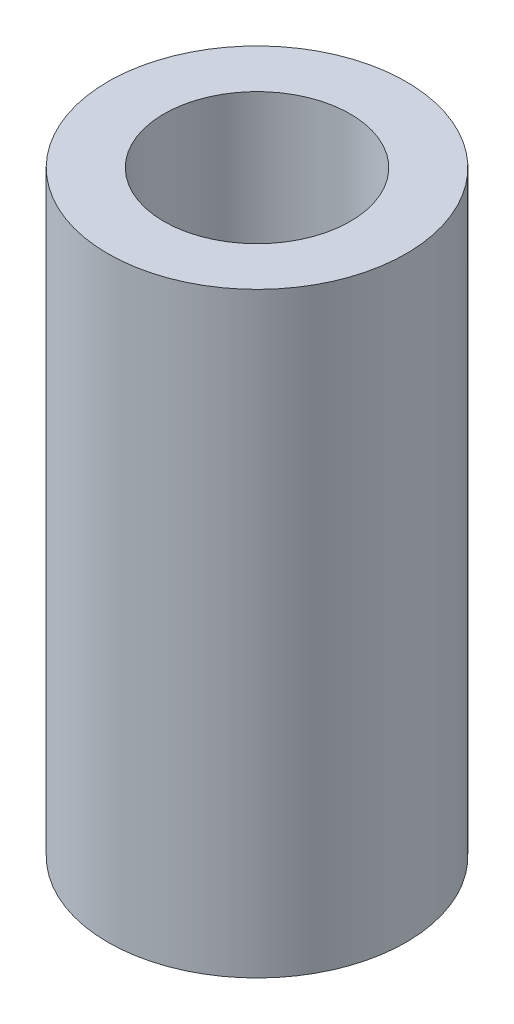
ISO-10303-21;
HEADER;
FILE_DESCRIPTION(('STEP AP214'),'2;1');
FILE_NAME('part.step','',(''),(''),'','','');
FILE_SCHEMA(('AUTOMOTIVE_DESIGN { 1 0 10303 214 1 1 1 1 }'));
ENDSEC;
DATA;
#1=APPLICATION_CONTEXT('core data for automotive mechanical design processes');
#2=APPLICATION_PROTOCOL_DEFINITION('international standard','automotive_design',2000,#1);
#3=PRODUCT_CONTEXT('',#1,'mechanical');
#4=PRODUCT('Part','Part','',(#3));
#5=PRODUCT_RELATED_PRODUCT_CATEGORY('part','',(#4));
#6=PRODUCT_DEFINITION_FORMATION('','',#4);
#7=PRODUCT_DEFINITION_CONTEXT('part definition',#1,'design');
#8=PRODUCT_DEFINITION('design','',#6,#7);
#9=PRODUCT_DEFINITION_SHAPE('','',#8);
#10=(LENGTH_UNIT() NAMED_UNIT(*) SI_UNIT(.MILLI.,.METRE.));
#11=(NAMED_UNIT(*) PLANE_ANGLE_UNIT() SI_UNIT($,.RADIAN.));
#12=(NAMED_UNIT(*) SI_UNIT($,.STERADIAN.) SOLID_ANGLE_UNIT());
#13=UNCERTAINTY_MEASURE_WITH_UNIT(LENGTH_MEASURE(1.E-05),#10,'distance_accuracy_value','');
#14=(GEOMETRIC_REPRESENTATION_CONTEXT(3) GLOBAL_UNCERTAINTY_ASSIGNED_CONTEXT((#13)) GLOBAL_UNIT_ASSIGNED_CONTEXT((#10,
#11,#12)) REPRESENTATION_CONTEXT('',''));
#15=CARTESIAN_POINT('',(0.,0.,0.));
#16=DIRECTION('',(0.,0.,1.));
#17=DIRECTION('',(1.,0.,0.));
#18=AXIS2_PLACEMENT_3D('',#15,#16,#17);
#19=CARTESIAN_POINT('',(0.,32.,0.));
#20=DIRECTION('',(0.,1.,0.));
#21=DIRECTION('',(0.,0.,1.));
#22=AXIS2_PLACEMENT_3D('',#19,#20,#21);
#23=PLANE('',#22);
#24=CARTESIAN_POINT('',(0.,32.,0.));
#25=DIRECTION('',(0.,1.,0.));
#26=DIRECTION('',(0.,0.,1.));
#27=AXIS2_PLACEMENT_3D('',#24,#25,#26);
#28=CIRCLE('',#27,8.);
#29=CARTESIAN_POINT('',(0.,32.,8.));
#30=VERTEX_POINT('',#29);
#31=EDGE_CURVE('E10',#30,#30,#28,.T.);
#32=ORIENTED_EDGE('',*,*,#31,.T.);
#33=EDGE_LOOP('',(#32));
#34=FACE_BOUND('',#33,.T.);
#35=CARTESIAN_POINT('',(0.,32.,0.));
#36=DIRECTION('',(0.,1.,0.));
#37=DIRECTION('',(0.,0.,1.));
#38=AXIS2_PLACEMENT_3D('',#35,#36,#37);
#39=CIRCLE('',#38,5.);
#40=CARTESIAN_POINT('',(0.,32.,5.));
#41=VERTEX_POINT('',#40);
#42=EDGE_CURVE('E56',#41,#41,#39,.T.);
#43=ORIENTED_EDGE('',*,*,#42,.F.);
#44=EDGE_LOOP('',(#43));
#45=FACE_BOUND('',#44,.T.);
#46=ADVANCED_FACE('F41',(#34,#45),#23,.T.);
#47=CARTESIAN_POINT('',(0.,0.,0.));
#48=DIRECTION('',(0.,1.,0.));
#49=DIRECTION('',(0.,0.,1.));
#50=AXIS2_PLACEMENT_3D('',#47,#48,#49);
#51=PLANE('',#50);
#52=CARTESIAN_POINT('',(0.,0.,0.));
#53=DIRECTION('',(0.,1.,0.));
#54=DIRECTION('',(0.,0.,1.));
#55=AXIS2_PLACEMENT_3D('',#52,#53,#54);
#56=CIRCLE('',#55,8.);
#57=CARTESIAN_POINT('',(0.,0.,8.));
#58=VERTEX_POINT('',#57);
#59=EDGE_CURVE('E45',#58,#58,#56,.T.);
#60=ORIENTED_EDGE('',*,*,#59,.F.);
#61=EDGE_LOOP('',(#60));
#62=FACE_BOUND('',#61,.T.);
#63=CARTESIAN_POINT('',(0.,0.,0.));
#64=DIRECTION('',(0.,1.,0.));
#65=DIRECTION('',(0.,0.,1.));
#66=AXIS2_PLACEMENT_3D('',#63,#64,#65);
#67=CIRCLE('',#66,5.);
#68=CARTESIAN_POINT('',(0.,0.,5.));
#69=VERTEX_POINT('',#68);
#70=EDGE_CURVE('E58',#69,#69,#67,.T.);
#71=ORIENTED_EDGE('',*,*,#70,.T.);
#72=EDGE_LOOP('',(#71));
#73=FACE_BOUND('',#72,.T.);
#74=ADVANCED_FACE('F70',(#62,#73),#51,.F.);
#75=CARTESIAN_POINT('',(0.,32.,0.));
#76=DIRECTION('',(0.,-1.,0.));
#77=DIRECTION('',(0.,0.,-1.));
#78=AXIS2_PLACEMENT_3D('',#75,#76,#77);
#79=CYLINDRICAL_SURFACE('',#78,8.);
#80=ORIENTED_EDGE('',*,*,#31,.F.);
#81=EDGE_LOOP('',(#80));
#82=FACE_BOUND('',#81,.T.);
#83=ORIENTED_EDGE('',*,*,#59,.T.);
#84=EDGE_LOOP('',(#83));
#85=FACE_BOUND('',#84,.T.);
#86=ADVANCED_FACE('F43',(#82,#85),#79,.T.);
#87=CARTESIAN_POINT('',(0.,32.,0.));
#88=DIRECTION('',(0.,-1.,0.));
#89=DIRECTION('',(0.,0.,-1.));
#90=AXIS2_PLACEMENT_3D('',#87,#88,#89);
#91=CYLINDRICAL_SURFACE('',#90,5.);
#92=ORIENTED_EDGE('',*,*,#42,.T.);
#93=EDGE_LOOP('',(#92));
#94=FACE_BOUND('',#93,.T.);
#95=ORIENTED_EDGE('',*,*,#70,.F.);
#96=EDGE_LOOP('',(#95));
#97=FACE_BOUND('',#96,.T.);
#98=ADVANCED_FACE('F66',(#94,#97),#91,.F.);
#99=CLOSED_SHELL('',(#46,#74,#86,#98));
#100=MANIFOLD_SOLID_BREP('B2',#99);
#101=ADVANCED_BREP_SHAPE_REPRESENTATION('',(#18,#100),#14);
#102=SHAPE_DEFINITION_REPRESENTATION(#9,#101);
ENDSEC;
END-ISO-10303-21;
